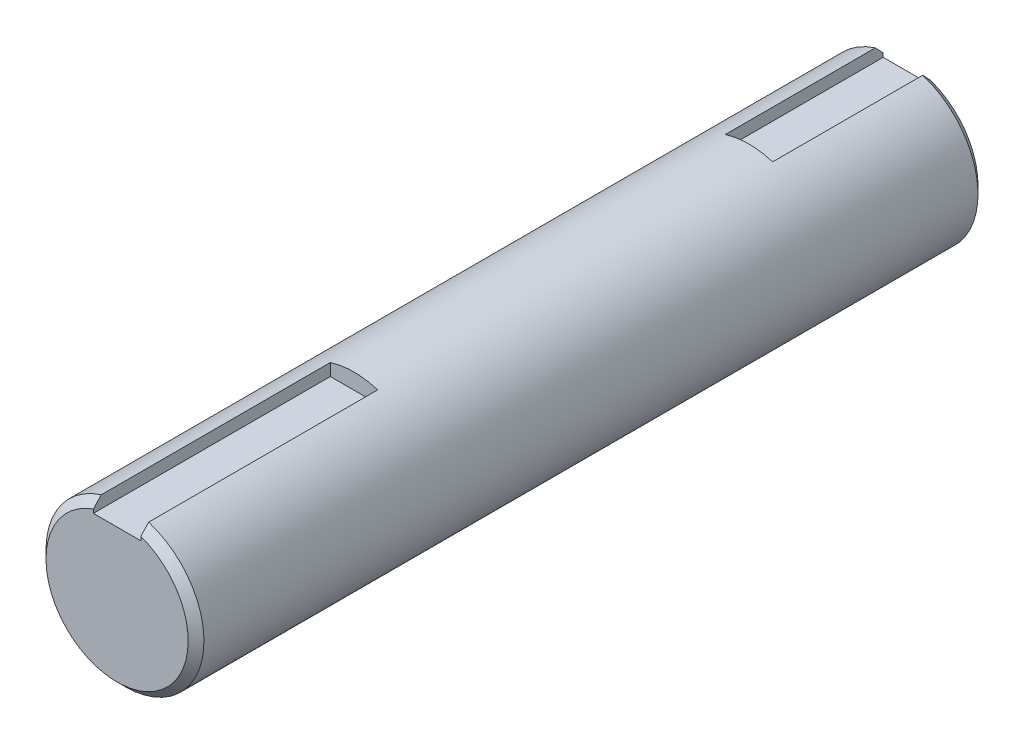
ISO-10303-21;
HEADER;
FILE_DESCRIPTION(('STEP AP214'),'2;1');
FILE_NAME('part.step','',(''),(''),'','','');
FILE_SCHEMA(('AUTOMOTIVE_DESIGN { 1 0 10303 214 1 1 1 1 }'));
ENDSEC;
DATA;
#1=APPLICATION_CONTEXT('core data for automotive mechanical design processes');
#2=APPLICATION_PROTOCOL_DEFINITION('international standard','automotive_design',2000,#1);
#3=PRODUCT_CONTEXT('',#1,'mechanical');
#4=PRODUCT('Part','Part','',(#3));
#5=PRODUCT_RELATED_PRODUCT_CATEGORY('part','',(#4));
#6=PRODUCT_DEFINITION_FORMATION('','',#4);
#7=PRODUCT_DEFINITION_CONTEXT('part definition',#1,'design');
#8=PRODUCT_DEFINITION('design','',#6,#7);
#9=PRODUCT_DEFINITION_SHAPE('','',#8);
#10=(LENGTH_UNIT() NAMED_UNIT(*) SI_UNIT(.MILLI.,.METRE.));
#11=(NAMED_UNIT(*) PLANE_ANGLE_UNIT() SI_UNIT($,.RADIAN.));
#12=(NAMED_UNIT(*) SI_UNIT($,.STERADIAN.) SOLID_ANGLE_UNIT());
#13=UNCERTAINTY_MEASURE_WITH_UNIT(LENGTH_MEASURE(1.E-05),#10,'distance_accuracy_value','');
#14=(GEOMETRIC_REPRESENTATION_CONTEXT(3) GLOBAL_UNCERTAINTY_ASSIGNED_CONTEXT((#13)) GLOBAL_UNIT_ASSIGNED_CONTEXT((#10,
#11,#12)) REPRESENTATION_CONTEXT('',''));
#15=CARTESIAN_POINT('',(0.,0.,0.));
#16=DIRECTION('',(0.,0.,1.));
#17=DIRECTION('',(1.,0.,0.));
#18=AXIS2_PLACEMENT_3D('',#15,#16,#17);
#19=CARTESIAN_POINT('',(0.,0.,100.));
#20=DIRECTION('',(0.,0.,-1.));
#21=DIRECTION('',(-1.,0.,0.));
#22=AXIS2_PLACEMENT_3D('',#19,#20,#21);
#23=CYLINDRICAL_SURFACE('',#22,10.);
#24=DIRECTION('',(0.,0.,-1.));
#25=VECTOR('',#24,1.);
#26=CARTESIAN_POINT('',(-3.,9.53939201416945,100.));
#27=LINE('',#26,#25);
#28=CARTESIAN_POINT('',(-3.,9.53939201416945,20.));
#29=VERTEX_POINT('',#28);
#30=CARTESIAN_POINT('',(-3.,9.53939201416945,1.));
#31=VERTEX_POINT('',#30);
#32=EDGE_CURVE('E147',#29,#31,#27,.T.);
#33=ORIENTED_EDGE('',*,*,#32,.T.);
#34=CARTESIAN_POINT('',(0.,0.,1.));
#35=DIRECTION('',(0.,0.,1.));
#36=DIRECTION('',(1.,0.,0.));
#37=AXIS2_PLACEMENT_3D('',#34,#35,#36);
#38=CIRCLE('',#37,10.);
#39=CARTESIAN_POINT('',(3.,9.53939201416945,1.));
#40=VERTEX_POINT('',#39);
#41=EDGE_CURVE('E186',#31,#40,#38,.T.);
#42=ORIENTED_EDGE('',*,*,#41,.T.);
#43=DIRECTION('',(0.,0.,-1.));
#44=VECTOR('',#43,1.);
#45=CARTESIAN_POINT('',(3.,9.53939201416945,100.));
#46=LINE('',#45,#44);
#47=CARTESIAN_POINT('',(3.,9.53939201416945,20.));
#48=VERTEX_POINT('',#47);
#49=EDGE_CURVE('E151',#40,#48,#46,.F.);
#50=ORIENTED_EDGE('',*,*,#49,.T.);
#51=CARTESIAN_POINT('',(0.,0.,20.));
#52=DIRECTION('',(0.,0.,-1.));
#53=DIRECTION('',(-1.,0.,0.));
#54=AXIS2_PLACEMENT_3D('',#51,#52,#53);
#55=CIRCLE('',#54,10.);
#56=EDGE_CURVE('E122',#29,#48,#55,.T.);
#57=ORIENTED_EDGE('',*,*,#56,.F.);
#58=EDGE_LOOP('',(#33,#42,#50,#57));
#59=FACE_BOUND('',#58,.T.);
#60=DIRECTION('',(0.,0.,-1.));
#61=VECTOR('',#60,1.);
#62=CARTESIAN_POINT('',(3.,9.53939201416945,100.));
#63=LINE('',#62,#61);
#64=CARTESIAN_POINT('',(3.,9.53939201416945,70.));
#65=VERTEX_POINT('',#64);
#66=CARTESIAN_POINT('',(3.,9.53939201416945,99.));
#67=VERTEX_POINT('',#66);
#68=EDGE_CURVE('E170',#65,#67,#63,.F.);
#69=ORIENTED_EDGE('',*,*,#68,.T.);
#70=CARTESIAN_POINT('',(0.,0.,99.));
#71=DIRECTION('',(0.,0.,1.));
#72=DIRECTION('',(1.,0.,0.));
#73=AXIS2_PLACEMENT_3D('',#70,#71,#72);
#74=CIRCLE('',#73,10.);
#75=CARTESIAN_POINT('',(-3.,9.53939201416945,99.));
#76=VERTEX_POINT('',#75);
#77=EDGE_CURVE('E184',#67,#76,#74,.F.);
#78=ORIENTED_EDGE('',*,*,#77,.T.);
#79=DIRECTION('',(0.,0.,-1.));
#80=VECTOR('',#79,1.);
#81=CARTESIAN_POINT('',(-3.,9.53939201416945,100.));
#82=LINE('',#81,#80);
#83=CARTESIAN_POINT('',(-3.,9.53939201416945,70.));
#84=VERTEX_POINT('',#83);
#85=EDGE_CURVE('E175',#76,#84,#82,.T.);
#86=ORIENTED_EDGE('',*,*,#85,.T.);
#87=CARTESIAN_POINT('',(0.,0.,70.));
#88=DIRECTION('',(0.,0.,1.));
#89=DIRECTION('',(1.,0.,0.));
#90=AXIS2_PLACEMENT_3D('',#87,#88,#89);
#91=CIRCLE('',#90,10.);
#92=EDGE_CURVE('E179',#65,#84,#91,.T.);
#93=ORIENTED_EDGE('',*,*,#92,.F.);
#94=EDGE_LOOP('',(#69,#78,#86,#93));
#95=FACE_BOUND('',#94,.T.);
#96=ADVANCED_FACE('F33',(#59,#95),#23,.T.);
#97=CARTESIAN_POINT('',(0.,0.,100.));
#98=DIRECTION('',(0.,0.,1.));
#99=DIRECTION('',(1.,0.,0.));
#100=AXIS2_PLACEMENT_3D('',#97,#98,#99);
#101=PLANE('',#100);
#102=DIRECTION('',(0.,-1.,0.));
#103=VECTOR('',#102,1.);
#104=CARTESIAN_POINT('',(-3.,0.,100.));
#105=LINE('',#104,#103);
#106=CARTESIAN_POINT('',(-3.,8.48528137423856,100.));
#107=VERTEX_POINT('',#106);
#108=CARTESIAN_POINT('',(-3.,8.,100.));
#109=VERTEX_POINT('',#108);
#110=EDGE_CURVE('E177',#107,#109,#105,.T.);
#111=ORIENTED_EDGE('',*,*,#110,.F.);
#112=CARTESIAN_POINT('',(0.,0.,100.));
#113=DIRECTION('',(0.,0.,1.));
#114=DIRECTION('',(1.,0.,0.));
#115=AXIS2_PLACEMENT_3D('',#112,#113,#114);
#116=CIRCLE('',#115,8.99999999999999);
#117=CARTESIAN_POINT('',(3.,8.48528137423856,100.));
#118=VERTEX_POINT('',#117);
#119=EDGE_CURVE('E222',#107,#118,#116,.T.);
#120=ORIENTED_EDGE('',*,*,#119,.T.);
#121=DIRECTION('',(0.,1.,0.));
#122=VECTOR('',#121,1.);
#123=CARTESIAN_POINT('',(3.,10.8500647795069,100.));
#124=LINE('',#123,#122);
#125=CARTESIAN_POINT('',(3.,8.,100.));
#126=VERTEX_POINT('',#125);
#127=EDGE_CURVE('E157',#126,#118,#124,.T.);
#128=ORIENTED_EDGE('',*,*,#127,.F.);
#129=DIRECTION('',(1.,0.,0.));
#130=VECTOR('',#129,1.);
#131=CARTESIAN_POINT('',(-3.,8.,100.));
#132=LINE('',#131,#130);
#133=EDGE_CURVE('E153',#109,#126,#132,.T.);
#134=ORIENTED_EDGE('',*,*,#133,.F.);
#135=EDGE_LOOP('',(#111,#120,#128,#134));
#136=FACE_BOUND('',#135,.T.);
#137=ADVANCED_FACE('F237',(#136),#101,.T.);
#138=CARTESIAN_POINT('',(0.,0.,0.));
#139=DIRECTION('',(0.,0.,1.));
#140=DIRECTION('',(1.,0.,0.));
#141=AXIS2_PLACEMENT_3D('',#138,#139,#140);
#142=PLANE('',#141);
#143=DIRECTION('',(0.,1.,0.));
#144=VECTOR('',#143,1.);
#145=CARTESIAN_POINT('',(3.,0.,0.));
#146=LINE('',#145,#144);
#147=CARTESIAN_POINT('',(3.,8.,0.));
#148=VERTEX_POINT('',#147);
#149=CARTESIAN_POINT('',(3.,8.48528137423856,0.));
#150=VERTEX_POINT('',#149);
#151=EDGE_CURVE('E131',#148,#150,#146,.T.);
#152=ORIENTED_EDGE('',*,*,#151,.T.);
#153=CARTESIAN_POINT('',(0.,0.,0.));
#154=DIRECTION('',(0.,0.,1.));
#155=DIRECTION('',(1.,0.,0.));
#156=AXIS2_PLACEMENT_3D('',#153,#154,#155);
#157=CIRCLE('',#156,8.99999999999999);
#158=CARTESIAN_POINT('',(-3.,8.48528137423856,0.));
#159=VERTEX_POINT('',#158);
#160=EDGE_CURVE('E195',#150,#159,#157,.F.);
#161=ORIENTED_EDGE('',*,*,#160,.T.);
#162=DIRECTION('',(0.,1.,0.));
#163=VECTOR('',#162,1.);
#164=CARTESIAN_POINT('',(-3.,10.6608970051792,0.));
#165=LINE('',#164,#163);
#166=CARTESIAN_POINT('',(-3.,8.,0.));
#167=VERTEX_POINT('',#166);
#168=EDGE_CURVE('E125',#167,#159,#165,.T.);
#169=ORIENTED_EDGE('',*,*,#168,.F.);
#170=DIRECTION('',(-1.,0.,0.));
#171=VECTOR('',#170,1.);
#172=CARTESIAN_POINT('',(3.,8.,0.));
#173=LINE('',#172,#171);
#174=EDGE_CURVE('E143',#148,#167,#173,.T.);
#175=ORIENTED_EDGE('',*,*,#174,.F.);
#176=EDGE_LOOP('',(#152,#161,#169,#175));
#177=FACE_BOUND('',#176,.T.);
#178=ADVANCED_FACE('F210',(#177),#142,.F.);
#179=CARTESIAN_POINT('',(0.,0.,70.));
#180=DIRECTION('',(0.,0.,1.));
#181=DIRECTION('',(1.,0.,0.));
#182=AXIS2_PLACEMENT_3D('',#179,#180,#181);
#183=PLANE('',#182);
#184=ORIENTED_EDGE('',*,*,#92,.T.);
#185=DIRECTION('',(0.,-1.,0.));
#186=VECTOR('',#185,1.);
#187=CARTESIAN_POINT('',(-3.,10.8500647795069,70.));
#188=LINE('',#187,#186);
#189=CARTESIAN_POINT('',(-3.,8.,70.));
#190=VERTEX_POINT('',#189);
#191=EDGE_CURVE('E154',#84,#190,#188,.T.);
#192=ORIENTED_EDGE('',*,*,#191,.T.);
#193=DIRECTION('',(1.,0.,0.));
#194=VECTOR('',#193,1.);
#195=CARTESIAN_POINT('',(-3.,8.,70.));
#196=LINE('',#195,#194);
#197=CARTESIAN_POINT('',(3.,8.,70.));
#198=VERTEX_POINT('',#197);
#199=EDGE_CURVE('E156',#190,#198,#196,.T.);
#200=ORIENTED_EDGE('',*,*,#199,.T.);
#201=DIRECTION('',(0.,1.,0.));
#202=VECTOR('',#201,1.);
#203=CARTESIAN_POINT('',(3.,10.8500647795069,70.));
#204=LINE('',#203,#202);
#205=EDGE_CURVE('E160',#198,#65,#204,.T.);
#206=ORIENTED_EDGE('',*,*,#205,.T.);
#207=EDGE_LOOP('',(#184,#192,#200,#206));
#208=FACE_BOUND('',#207,.T.);
#209=ADVANCED_FACE('F206',(#208),#183,.T.);
#210=CARTESIAN_POINT('',(-3.,10.8500647795069,70.));
#211=DIRECTION('',(-1.,0.,0.));
#212=DIRECTION('',(0.,0.,1.));
#213=AXIS2_PLACEMENT_3D('',#210,#211,#212);
#214=PLANE('',#213);
#215=ORIENTED_EDGE('',*,*,#85,.F.);
#216=CARTESIAN_POINT('',(-3.,9.53939201416945,99.));
#217=CARTESIAN_POINT('',(-3.,9.45178007501303,99.0835761473583));
#218=CARTESIAN_POINT('',(-3.,9.3641166826507,99.1670983827707));
#219=CARTESIAN_POINT('',(-3.,9.18867804940366,99.3340249221561));
#220=CARTESIAN_POINT('',(-3.,9.10090280875815,99.4174292263807));
#221=CARTESIAN_POINT('',(-3.,8.92523113528877,99.58411017891));
#222=CARTESIAN_POINT('',(-3.,8.83733470242696,99.6673868271749));
#223=CARTESIAN_POINT('',(-3.,8.66140974517747,99.8338008530443));
#224=CARTESIAN_POINT('',(-3.,8.57338122050807,99.9169382303511));
#225=CARTESIAN_POINT('',(-3.,8.48528137423856,100.));
#226=B_SPLINE_CURVE_WITH_KNOTS('',3,(#216,#217,#218,#219,#220,#221,#222,#223,#224,#225),
.UNSPECIFIED.,.F.,.F.,(4,2,2,2,4),(0.,0.363245675188843,0.726490574813659,1.08973558818002,
1.45298137735093),.UNSPECIFIED.);
#227=EDGE_CURVE('E11',#76,#107,#226,.T.);
#228=ORIENTED_EDGE('',*,*,#227,.T.);
#229=ORIENTED_EDGE('',*,*,#110,.T.);
#230=DIRECTION('',(0.,0.,1.));
#231=VECTOR('',#230,1.);
#232=CARTESIAN_POINT('',(-3.,8.,70.));
#233=LINE('',#232,#231);
#234=EDGE_CURVE('E163',#190,#109,#233,.T.);
#235=ORIENTED_EDGE('',*,*,#234,.F.);
#236=ORIENTED_EDGE('',*,*,#191,.F.);
#237=EDGE_LOOP('',(#215,#228,#229,#235,#236));
#238=FACE_BOUND('',#237,.T.);
#239=ADVANCED_FACE('F209',(#238),#214,.F.);
#240=CARTESIAN_POINT('',(3.,10.8500647795069,70.));
#241=DIRECTION('',(1.,0.,0.));
#242=DIRECTION('',(0.,0.,-1.));
#243=AXIS2_PLACEMENT_3D('',#240,#241,#242);
#244=PLANE('',#243);
#245=ORIENTED_EDGE('',*,*,#127,.T.);
#246=CARTESIAN_POINT('',(3.,8.48528137423856,100.));
#247=CARTESIAN_POINT('',(3.,8.57338122050807,99.9169382303511));
#248=CARTESIAN_POINT('',(3.,8.66140974517747,99.8338008530443));
#249=CARTESIAN_POINT('',(3.,8.83733470242696,99.6673868271749));
#250=CARTESIAN_POINT('',(3.,8.92523113528877,99.58411017891));
#251=CARTESIAN_POINT('',(3.,9.10090280875814,99.4174292263807));
#252=CARTESIAN_POINT('',(3.,9.18867804940365,99.3340249221562));
#253=CARTESIAN_POINT('',(3.,9.3641166826507,99.1670983827707));
#254=CARTESIAN_POINT('',(3.,9.45178007501303,99.0835761473583));
#255=CARTESIAN_POINT('',(3.,9.53939201416945,99.));
#256=B_SPLINE_CURVE_WITH_KNOTS('',3,(#246,#247,#248,#249,#250,#251,#252,#253,#254,#255),
.UNSPECIFIED.,.F.,.F.,(4,2,2,2,4),(0.,0.363245789170907,0.726490802537265,1.08973570216206,
1.45298137735092),.UNSPECIFIED.);
#257=EDGE_CURVE('E46',#118,#67,#256,.T.);
#258=ORIENTED_EDGE('',*,*,#257,.T.);
#259=ORIENTED_EDGE('',*,*,#68,.F.);
#260=ORIENTED_EDGE('',*,*,#205,.F.);
#261=DIRECTION('',(0.,0.,1.));
#262=VECTOR('',#261,1.);
#263=CARTESIAN_POINT('',(3.,8.,70.));
#264=LINE('',#263,#262);
#265=EDGE_CURVE('E168',#198,#126,#264,.T.);
#266=ORIENTED_EDGE('',*,*,#265,.T.);
#267=EDGE_LOOP('',(#245,#258,#259,#260,#266));
#268=FACE_BOUND('',#267,.T.);
#269=ADVANCED_FACE('F212',(#268),#244,.F.);
#270=CARTESIAN_POINT('',(-3.,8.,70.));
#271=DIRECTION('',(0.,-1.,0.));
#272=DIRECTION('',(0.,0.,-1.));
#273=AXIS2_PLACEMENT_3D('',#270,#271,#272);
#274=PLANE('',#273);
#275=ORIENTED_EDGE('',*,*,#133,.T.);
#276=ORIENTED_EDGE('',*,*,#265,.F.);
#277=ORIENTED_EDGE('',*,*,#199,.F.);
#278=ORIENTED_EDGE('',*,*,#234,.T.);
#279=EDGE_LOOP('',(#275,#276,#277,#278));
#280=FACE_BOUND('',#279,.T.);
#281=ADVANCED_FACE('F216',(#280),#274,.F.);
#282=CARTESIAN_POINT('',(0.,0.,20.));
#283=DIRECTION('',(0.,0.,-1.));
#284=DIRECTION('',(-1.,0.,0.));
#285=AXIS2_PLACEMENT_3D('',#282,#283,#284);
#286=PLANE('',#285);
#287=ORIENTED_EDGE('',*,*,#56,.T.);
#288=DIRECTION('',(0.,-1.,0.));
#289=VECTOR('',#288,1.);
#290=CARTESIAN_POINT('',(3.,10.6608970051792,20.));
#291=LINE('',#290,#289);
#292=CARTESIAN_POINT('',(3.,8.,20.));
#293=VERTEX_POINT('',#292);
#294=EDGE_CURVE('E115',#48,#293,#291,.T.);
#295=ORIENTED_EDGE('',*,*,#294,.T.);
#296=DIRECTION('',(-1.,0.,0.));
#297=VECTOR('',#296,1.);
#298=CARTESIAN_POINT('',(3.,8.,20.));
#299=LINE('',#298,#297);
#300=CARTESIAN_POINT('',(-3.,8.,20.));
#301=VERTEX_POINT('',#300);
#302=EDGE_CURVE('E120',#293,#301,#299,.T.);
#303=ORIENTED_EDGE('',*,*,#302,.T.);
#304=DIRECTION('',(0.,1.,0.));
#305=VECTOR('',#304,1.);
#306=CARTESIAN_POINT('',(-3.,10.6608970051792,20.));
#307=LINE('',#306,#305);
#308=EDGE_CURVE('E136',#301,#29,#307,.T.);
#309=ORIENTED_EDGE('',*,*,#308,.T.);
#310=EDGE_LOOP('',(#287,#295,#303,#309));
#311=FACE_BOUND('',#310,.T.);
#312=ADVANCED_FACE('F117',(#311),#286,.T.);
#313=CARTESIAN_POINT('',(3.,10.6608970051792,20.));
#314=DIRECTION('',(1.,0.,0.));
#315=DIRECTION('',(0.,0.,-1.));
#316=AXIS2_PLACEMENT_3D('',#313,#314,#315);
#317=PLANE('',#316);
#318=ORIENTED_EDGE('',*,*,#49,.F.);
#319=CARTESIAN_POINT('',(3.,9.53939201416945,1.));
#320=CARTESIAN_POINT('',(3.,9.45178007501303,0.916423852641713));
#321=CARTESIAN_POINT('',(3.,9.3641166826507,0.832901617229342));
#322=CARTESIAN_POINT('',(3.,9.18867804940366,0.665975077843845));
#323=CARTESIAN_POINT('',(3.,9.10090280875815,0.582570773619305));
#324=CARTESIAN_POINT('',(3.,8.92523113528877,0.415889821089955));
#325=CARTESIAN_POINT('',(3.,8.83733470242696,0.332613172825125));
#326=CARTESIAN_POINT('',(3.,8.66140974517747,0.166199146955665));
#327=CARTESIAN_POINT('',(3.,8.57338122050807,0.083061769648863));
#328=CARTESIAN_POINT('',(3.,8.48528137423856,0.));
#329=B_SPLINE_CURVE_WITH_KNOTS('',3,(#319,#320,#321,#322,#323,#324,#325,#326,#327,#328),
.UNSPECIFIED.,.F.,.F.,(4,2,2,2,4),(0.,0.36324567518885,0.726490574813662,1.08973558818002,
1.45298137735093),.UNSPECIFIED.);
#330=EDGE_CURVE('E189',#40,#150,#329,.T.);
#331=ORIENTED_EDGE('',*,*,#330,.T.);
#332=ORIENTED_EDGE('',*,*,#151,.F.);
#333=DIRECTION('',(0.,0.,-1.));
#334=VECTOR('',#333,1.);
#335=CARTESIAN_POINT('',(3.,8.,20.));
#336=LINE('',#335,#334);
#337=EDGE_CURVE('E128',#293,#148,#336,.T.);
#338=ORIENTED_EDGE('',*,*,#337,.F.);
#339=ORIENTED_EDGE('',*,*,#294,.F.);
#340=EDGE_LOOP('',(#318,#331,#332,#338,#339));
#341=FACE_BOUND('',#340,.T.);
#342=ADVANCED_FACE('F129',(#341),#317,.F.);
#343=CARTESIAN_POINT('',(-3.,10.6608970051792,20.));
#344=DIRECTION('',(-1.,0.,0.));
#345=DIRECTION('',(0.,0.,1.));
#346=AXIS2_PLACEMENT_3D('',#343,#344,#345);
#347=PLANE('',#346);
#348=ORIENTED_EDGE('',*,*,#168,.T.);
#349=CARTESIAN_POINT('',(-3.,8.48528137423856,0.));
#350=CARTESIAN_POINT('',(-3.,8.57338122050807,0.0830617696488646));
#351=CARTESIAN_POINT('',(-3.,8.66140974517747,0.166199146955666));
#352=CARTESIAN_POINT('',(-3.,8.83733470242696,0.332613172825126));
#353=CARTESIAN_POINT('',(-3.,8.92523113528877,0.415889821089955));
#354=CARTESIAN_POINT('',(-3.,9.10090280875815,0.582570773619305));
#355=CARTESIAN_POINT('',(-3.,9.18867804940366,0.665975077843845));
#356=CARTESIAN_POINT('',(-3.,9.3641166826507,0.832901617229342));
#357=CARTESIAN_POINT('',(-3.,9.45178007501303,0.916423852641714));
#358=CARTESIAN_POINT('',(-3.,9.53939201416945,1.));
#359=B_SPLINE_CURVE_WITH_KNOTS('',3,(#349,#350,#351,#352,#353,#354,#355,#356,#357,#358),
.UNSPECIFIED.,.F.,.F.,(4,2,2,2,4),(0.,0.363245789170907,0.726490802537262,1.08973570216207,
1.45298137735092),.UNSPECIFIED.);
#360=EDGE_CURVE('E223',#159,#31,#359,.T.);
#361=ORIENTED_EDGE('',*,*,#360,.T.);
#362=ORIENTED_EDGE('',*,*,#32,.F.);
#363=ORIENTED_EDGE('',*,*,#308,.F.);
#364=DIRECTION('',(0.,0.,-1.));
#365=VECTOR('',#364,1.);
#366=CARTESIAN_POINT('',(-3.,8.,20.));
#367=LINE('',#366,#365);
#368=EDGE_CURVE('E135',#301,#167,#367,.T.);
#369=ORIENTED_EDGE('',*,*,#368,.T.);
#370=EDGE_LOOP('',(#348,#361,#362,#363,#369));
#371=FACE_BOUND('',#370,.T.);
#372=ADVANCED_FACE('F204',(#371),#347,.F.);
#373=CARTESIAN_POINT('',(3.,8.,20.));
#374=DIRECTION('',(0.,-1.,0.));
#375=DIRECTION('',(0.,0.,-1.));
#376=AXIS2_PLACEMENT_3D('',#373,#374,#375);
#377=PLANE('',#376);
#378=ORIENTED_EDGE('',*,*,#174,.T.);
#379=ORIENTED_EDGE('',*,*,#368,.F.);
#380=ORIENTED_EDGE('',*,*,#302,.F.);
#381=ORIENTED_EDGE('',*,*,#337,.T.);
#382=EDGE_LOOP('',(#378,#379,#380,#381));
#383=FACE_BOUND('',#382,.T.);
#384=ADVANCED_FACE('F138',(#383),#377,.F.);
#385=CARTESIAN_POINT('',(0.,0.,1.));
#386=DIRECTION('',(0.,0.,1.));
#387=DIRECTION('',(1.,0.,0.));
#388=AXIS2_PLACEMENT_3D('',#385,#386,#387);
#389=CONICAL_SURFACE('',#388,10.,0.78539816339745);
#390=ORIENTED_EDGE('',*,*,#360,.F.);
#391=ORIENTED_EDGE('',*,*,#160,.F.);
#392=ORIENTED_EDGE('',*,*,#330,.F.);
#393=ORIENTED_EDGE('',*,*,#41,.F.);
#394=EDGE_LOOP('',(#390,#391,#392,#393));
#395=FACE_BOUND('',#394,.T.);
#396=ADVANCED_FACE('F197',(#395),#389,.T.);
#397=CARTESIAN_POINT('',(0.,0.,100.));
#398=DIRECTION('',(0.,0.,-1.));
#399=DIRECTION('',(-1.,0.,0.));
#400=AXIS2_PLACEMENT_3D('',#397,#398,#399);
#401=CONICAL_SURFACE('',#400,8.99999999999999,0.78539816339745);
#402=ORIENTED_EDGE('',*,*,#227,.F.);
#403=ORIENTED_EDGE('',*,*,#77,.F.);
#404=ORIENTED_EDGE('',*,*,#257,.F.);
#405=ORIENTED_EDGE('',*,*,#119,.F.);
#406=EDGE_LOOP('',(#402,#403,#404,#405));
#407=FACE_BOUND('',#406,.T.);
#408=ADVANCED_FACE('F35',(#407),#401,.T.);
#409=CLOSED_SHELL('',(#96,#137,#178,#209,#239,#269,#281,#312,#342,#372,#384,#396,#408));
#410=MANIFOLD_SOLID_BREP('B2',#409);
#411=ADVANCED_BREP_SHAPE_REPRESENTATION('',(#18,#410),#14);
#412=SHAPE_DEFINITION_REPRESENTATION(#9,#411);
ENDSEC;
END-ISO-10303-21;
